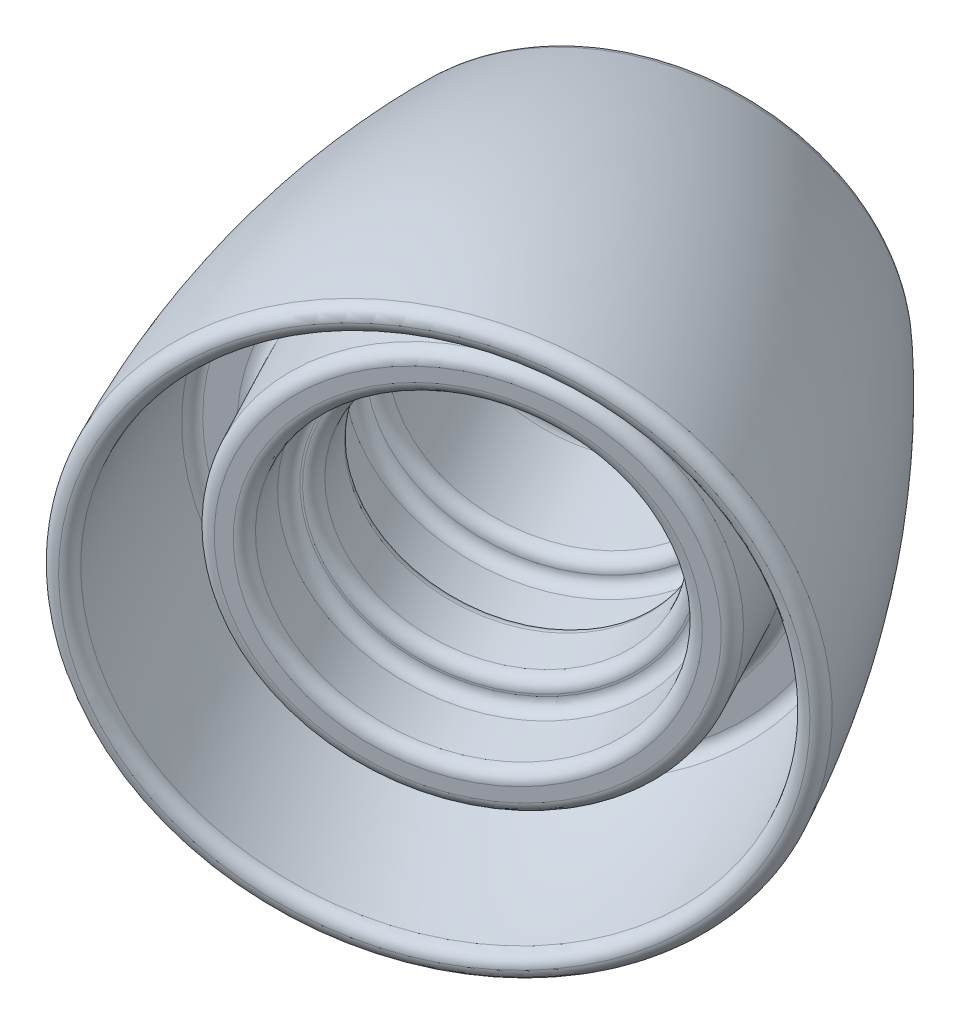
ISO-10303-21;
HEADER;
FILE_DESCRIPTION(('STEP AP214'),'2;1');
FILE_NAME('part.step','',(''),(''),'','','');
FILE_SCHEMA(('AUTOMOTIVE_DESIGN { 1 0 10303 214 1 1 1 1 }'));
ENDSEC;
DATA;
#1=APPLICATION_CONTEXT('core data for automotive mechanical design processes');
#2=APPLICATION_PROTOCOL_DEFINITION('international standard','automotive_design',2000,#1);
#3=PRODUCT_CONTEXT('',#1,'mechanical');
#4=PRODUCT('Part','Part','',(#3));
#5=PRODUCT_RELATED_PRODUCT_CATEGORY('part','',(#4));
#6=PRODUCT_DEFINITION_FORMATION('','',#4);
#7=PRODUCT_DEFINITION_CONTEXT('part definition',#1,'design');
#8=PRODUCT_DEFINITION('design','',#6,#7);
#9=PRODUCT_DEFINITION_SHAPE('','',#8);
#10=(LENGTH_UNIT() NAMED_UNIT(*) SI_UNIT(.MILLI.,.METRE.));
#11=(NAMED_UNIT(*) PLANE_ANGLE_UNIT() SI_UNIT($,.RADIAN.));
#12=(NAMED_UNIT(*) SI_UNIT($,.STERADIAN.) SOLID_ANGLE_UNIT());
#13=UNCERTAINTY_MEASURE_WITH_UNIT(LENGTH_MEASURE(1.E-05),#10,'distance_accuracy_value','');
#14=(GEOMETRIC_REPRESENTATION_CONTEXT(3) GLOBAL_UNCERTAINTY_ASSIGNED_CONTEXT((#13)) GLOBAL_UNIT_ASSIGNED_CONTEXT((#10,
#11,#12)) REPRESENTATION_CONTEXT('',''));
#15=CARTESIAN_POINT('',(0.,0.,0.));
#16=DIRECTION('',(0.,0.,1.));
#17=DIRECTION('',(1.,0.,0.));
#18=AXIS2_PLACEMENT_3D('',#15,#16,#17);
#19=CARTESIAN_POINT('',(-1.82840361063118,-8.23663197239245,23.7918539048536));
#20=DIRECTION('',(0.453212083113773,-0.0300186712748521,0.890897124866035));
#21=DIRECTION('',(-0.41626094218873,-0.890897124866035,0.181739211271491));
#22=AXIS2_PLACEMENT_3D('',#19,#20,#21);
#23=CYLINDRICAL_SURFACE('',#22,3.24582561371548);
#24=CARTESIAN_POINT('',(-6.10445961480962,-7.95340580891422,15.3862395317425));
#25=DIRECTION('',(0.453212083113773,-0.0300186712748521,0.890897124866035));
#26=DIRECTION('',(-0.41626094218873,-0.890897124866035,0.181739211271491));
#27=AXIS2_PLACEMENT_3D('',#24,#25,#26);
#28=CIRCLE('',#27,3.24582561371548);
#29=CARTESIAN_POINT('',(-7.45557004295514,-10.8451025159899,15.976133318704));
#30=VERTEX_POINT('',#29);
#31=EDGE_CURVE('E95',#30,#30,#28,.F.);
#32=ORIENTED_EDGE('',*,*,#31,.T.);
#33=EDGE_LOOP('',(#32));
#34=FACE_BOUND('',#33,.T.);
#35=CARTESIAN_POINT('',(-5.60592632338447,-7.98642634731656,16.3662263690952));
#36=DIRECTION('',(-0.453212083113773,0.0300186712748521,-0.890897124866035));
#37=DIRECTION('',(0.41626094218873,0.890897124866035,-0.181739211271491));
#38=AXIS2_PLACEMENT_3D('',#35,#36,#37);
#39=CIRCLE('',#38,3.24582561371548);
#40=CARTESIAN_POINT('',(-4.25481589523895,-5.09472964024091,15.7763325821337));
#41=VERTEX_POINT('',#40);
#42=EDGE_CURVE('E98',#41,#41,#39,.F.);
#43=ORIENTED_EDGE('',*,*,#42,.T.);
#44=EDGE_LOOP('',(#43));
#45=FACE_BOUND('',#44,.T.);
#46=ADVANCED_FACE('F15',(#34,#45),#23,.F.);
#47=CARTESIAN_POINT('',(-4.36631390040934,-5.58336181099489,16.0972048205766));
#48=DIRECTION('',(-0.453212083113773,0.0300186712748521,-0.890897124866035));
#49=DIRECTION('',(0.41626094218873,0.890897124866035,-0.181739211271491));
#50=AXIS2_PLACEMENT_3D('',#47,#48,#49);
#51=PLANE('',#50);
#52=CARTESIAN_POINT('',(-5.49262330260603,-7.99393101513527,16.5889506503116));
#53=DIRECTION('',(-0.453212083113773,0.0300186712748521,-0.890897124866035));
#54=DIRECTION('',(0.41626094218873,0.890897124866035,-0.181739211271491));
#55=AXIS2_PLACEMENT_3D('',#52,#53,#54);
#56=CIRCLE('',#55,2.99582561371548);
#57=CARTESIAN_POINT('',(-4.24557811000769,-5.32495858927612,16.0444916661681));
#58=VERTEX_POINT('',#57);
#59=EDGE_CURVE('E88',#58,#58,#56,.T.);
#60=ORIENTED_EDGE('',*,*,#59,.T.);
#61=EDGE_LOOP('',(#60));
#62=FACE_BOUND('',#61,.T.);
#63=CARTESIAN_POINT('',(-5.49262330260603,-7.99393101513527,16.5889506503116));
#64=DIRECTION('',(-0.453212083113773,0.0300186712748521,-0.890897124866035));
#65=DIRECTION('',(0.41626094218873,0.890897124866035,-0.181739211271491));
#66=AXIS2_PLACEMENT_3D('',#63,#64,#65);
#67=CIRCLE('',#66,2.95577728545579);
#68=CARTESIAN_POINT('',(-4.26224866486216,-5.36063752977838,16.0517700177587));
#69=VERTEX_POINT('',#68);
#70=EDGE_CURVE('E91',#69,#69,#67,.F.);
#71=ORIENTED_EDGE('',*,*,#70,.T.);
#72=EDGE_LOOP('',(#71));
#73=FACE_BOUND('',#72,.T.);
#74=ADVANCED_FACE('F181',(#62,#73),#51,.T.);
#75=CARTESIAN_POINT('',(-1.82840361063118,-8.23663197239245,23.7918539048536));
#76=DIRECTION('',(0.453212083113773,-0.0300186712748521,0.890897124866035));
#77=DIRECTION('',(-0.41626094218873,-0.890897124866035,0.181739211271491));
#78=AXIS2_PLACEMENT_3D('',#75,#76,#77);
#79=CYLINDRICAL_SURFACE('',#78,2.70577728545579);
#80=CARTESIAN_POINT('',(-5.37932028182759,-8.00143568295398,16.8116749315281));
#81=DIRECTION('',(-0.453212083113773,0.0300186712748521,-0.890897124866035));
#82=DIRECTION('',(0.41626094218873,0.890897124866035,-0.181739211271491));
#83=AXIS2_PLACEMENT_3D('',#80,#81,#82);
#84=CIRCLE('',#83,2.70577728545579);
#85=CARTESIAN_POINT('',(-4.2530108796309,-5.5908664788136,16.3199291017931));
#86=VERTEX_POINT('',#85);
#87=EDGE_CURVE('E80',#86,#86,#84,.T.);
#88=ORIENTED_EDGE('',*,*,#87,.T.);
#89=EDGE_LOOP('',(#88));
#90=FACE_BOUND('',#89,.T.);
#91=CARTESIAN_POINT('',(-4.97142940702519,-8.02845248710135,17.6134823439076));
#92=DIRECTION('',(0.453212083113773,-0.0300186712748521,0.890897124866035));
#93=DIRECTION('',(-0.41626094218873,-0.890897124866035,0.181739211271491));
#94=AXIS2_PLACEMENT_3D('',#91,#92,#93);
#95=CIRCLE('',#94,2.70577728545579);
#96=CARTESIAN_POINT('',(-6.09773880922188,-10.4390216912417,18.1052281736427));
#97=VERTEX_POINT('',#96);
#98=EDGE_CURVE('E84',#97,#97,#95,.T.);
#99=ORIENTED_EDGE('',*,*,#98,.T.);
#100=EDGE_LOOP('',(#99));
#101=FACE_BOUND('',#100,.T.);
#102=ADVANCED_FACE('F177',(#90,#101),#79,.F.);
#103=CARTESIAN_POINT('',(-3.73181698405006,-5.62538795077968,17.3444607953891));
#104=DIRECTION('',(0.453212083113773,-0.0300186712748521,0.890897124866035));
#105=DIRECTION('',(-0.41626094218873,-0.890897124866035,0.181739211271491));
#106=AXIS2_PLACEMENT_3D('',#103,#104,#105);
#107=PLANE('',#106);
#108=CARTESIAN_POINT('',(-4.85812638624674,-8.03595715492006,17.8362066251241));
#109=DIRECTION('',(0.453212083113773,-0.0300186712748521,0.890897124866035));
#110=DIRECTION('',(-0.41626094218873,-0.890897124866035,0.181739211271491));
#111=AXIS2_PLACEMENT_3D('',#108,#109,#110);
#112=CIRCLE('',#111,2.95577728545579);
#113=CARTESIAN_POINT('',(-6.08850102399061,-10.669250640277,18.373387257677));
#114=VERTEX_POINT('',#113);
#115=EDGE_CURVE('E72',#114,#114,#112,.F.);
#116=ORIENTED_EDGE('',*,*,#115,.T.);
#117=EDGE_LOOP('',(#116));
#118=FACE_BOUND('',#117,.T.);
#119=CARTESIAN_POINT('',(-4.85812638624674,-8.03595715492006,17.8362066251241));
#120=DIRECTION('',(0.453212083113773,-0.0300186712748521,0.890897124866035));
#121=DIRECTION('',(-0.41626094218873,-0.890897124866035,0.181739211271491));
#122=AXIS2_PLACEMENT_3D('',#119,#120,#121);
#123=CIRCLE('',#122,2.99582561371548);
#124=CARTESIAN_POINT('',(-6.10517157884508,-10.7049295807792,18.3806656092677));
#125=VERTEX_POINT('',#124);
#126=EDGE_CURVE('E76',#125,#125,#123,.T.);
#127=ORIENTED_EDGE('',*,*,#126,.T.);
#128=EDGE_LOOP('',(#127));
#129=FACE_BOUND('',#128,.T.);
#130=ADVANCED_FACE('F173',(#118,#129),#107,.T.);
#131=CARTESIAN_POINT('',(-1.82840361063118,-8.23663197239245,23.7918539048536));
#132=DIRECTION('',(0.453212083113773,-0.0300186712748521,0.890897124866035));
#133=DIRECTION('',(-0.41626094218873,-0.890897124866035,0.181739211271491));
#134=AXIS2_PLACEMENT_3D('',#131,#132,#133);
#135=CYLINDRICAL_SURFACE('',#134,3.24582561371548);
#136=CARTESIAN_POINT('',(-4.7448233654683,-8.04346182273878,18.0589309063406));
#137=DIRECTION('',(0.453212083113773,-0.0300186712748521,0.890897124866035));
#138=DIRECTION('',(-0.41626094218873,-0.890897124866035,0.181739211271491));
#139=AXIS2_PLACEMENT_3D('',#136,#137,#138);
#140=CIRCLE('',#139,3.24582561371548);
#141=CARTESIAN_POINT('',(-6.09593379361382,-10.9351585298144,18.6488246933021));
#142=VERTEX_POINT('',#141);
#143=EDGE_CURVE('E64',#142,#142,#140,.F.);
#144=ORIENTED_EDGE('',*,*,#143,.T.);
#145=EDGE_LOOP('',(#144));
#146=FACE_BOUND('',#145,.T.);
#147=CARTESIAN_POINT('',(-4.2853736463624,-8.07389364615885,18.9620896018452));
#148=DIRECTION('',(0.453212083113773,-0.0300186712748521,0.890897124866035));
#149=DIRECTION('',(-0.41626094218873,-0.890897124866035,0.181739211271491));
#150=AXIS2_PLACEMENT_3D('',#147,#148,#149);
#151=CIRCLE('',#150,3.24582561371548);
#152=CARTESIAN_POINT('',(-5.63648407450792,-10.9655903532345,19.5519833888067));
#153=VERTEX_POINT('',#152);
#154=EDGE_CURVE('E68',#153,#153,#151,.T.);
#155=ORIENTED_EDGE('',*,*,#154,.T.);
#156=EDGE_LOOP('',(#155));
#157=FACE_BOUND('',#156,.T.);
#158=ADVANCED_FACE('F169',(#146,#157),#135,.F.);
#159=CARTESIAN_POINT('',(-2.82096019743843,-5.18970160690191,18.5949200961003));
#160=DIRECTION('',(0.453212083113773,-0.0300186712748521,0.890897124866035));
#161=DIRECTION('',(-0.41626094218873,-0.890897124866035,0.181739211271491));
#162=AXIS2_PLACEMENT_3D('',#159,#160,#161);
#163=PLANE('',#162);
#164=CARTESIAN_POINT('',(-4.17207062558396,-8.08139831397756,19.1848138830617));
#165=DIRECTION('',(0.453212083113773,-0.0300186712748521,0.890897124866035));
#166=DIRECTION('',(-0.41626094218873,-0.890897124866035,0.181739211271491));
#167=AXIS2_PLACEMENT_3D('',#164,#165,#166);
#168=CIRCLE('',#167,3.49582561371548);
#169=CARTESIAN_POINT('',(-5.62724628927666,-11.1958193022697,19.8201424728411));
#170=VERTEX_POINT('',#169);
#171=EDGE_CURVE('E38',#170,#170,#168,.F.);
#172=ORIENTED_EDGE('',*,*,#171,.T.);
#173=EDGE_LOOP('',(#172));
#174=FACE_BOUND('',#173,.T.);
#175=CARTESIAN_POINT('',(-4.17207062558396,-8.08139831397756,19.1848138830617));
#176=DIRECTION('',(0.453212083113773,-0.0300186712748521,0.890897124866035));
#177=DIRECTION('',(-0.41626094218873,-0.890897124866035,0.181739211271491));
#178=AXIS2_PLACEMENT_3D('',#175,#176,#177);
#179=CIRCLE('',#178,3.77857088456341);
#180=CARTESIAN_POINT('',(-5.74494210211922,-11.4477162511376,19.8715283753557));
#181=VERTEX_POINT('',#180);
#182=EDGE_CURVE('E44',#181,#181,#179,.T.);
#183=ORIENTED_EDGE('',*,*,#182,.T.);
#184=EDGE_LOOP('',(#183));
#185=FACE_BOUND('',#184,.T.);
#186=ADVANCED_FACE('F165',(#174,#185),#163,.T.);
#187=CARTESIAN_POINT('',(-1.82840361063118,-8.23663197239245,23.7918539048536));
#188=DIRECTION('',(0.453212083113773,-0.0300186712748521,0.890897124866035));
#189=DIRECTION('',(-0.41626094218873,-0.890897124866035,0.181739211271491));
#190=AXIS2_PLACEMENT_3D('',#187,#188,#189);
#191=CYLINDRICAL_SURFACE('',#190,4.02857088456341);
#192=CARTESIAN_POINT('',(-5.2320599834361,-8.01118952371409,17.1011503919848));
#193=DIRECTION('',(0.453212083113773,-0.0300186712748521,0.890897124866035));
#194=DIRECTION('',(-0.41626094218873,-0.890897124866035,0.181739211271491));
#195=AXIS2_PLACEMENT_3D('',#192,#193,#194);
#196=CIRCLE('',#195,4.02857088456341);
#197=CARTESIAN_POINT('',(-6.90899669551855,-11.6002317420906,17.8332996870967));
#198=VERTEX_POINT('',#197);
#199=EDGE_CURVE('E56',#198,#198,#196,.T.);
#200=ORIENTED_EDGE('',*,*,#199,.T.);
#201=EDGE_LOOP('',(#200));
#202=FACE_BOUND('',#201,.T.);
#203=CARTESIAN_POINT('',(-4.2853736463624,-8.07389364615885,18.9620896018452));
#204=DIRECTION('',(0.453212083113773,-0.0300186712748521,0.890897124866035));
#205=DIRECTION('',(-0.41626094218873,-0.890897124866035,0.181739211271491));
#206=AXIS2_PLACEMENT_3D('',#203,#204,#205);
#207=CIRCLE('',#206,4.02857088456341);
#208=CARTESIAN_POINT('',(-5.96231035844485,-11.6629358645354,19.694238896957));
#209=VERTEX_POINT('',#208);
#210=EDGE_CURVE('E60',#209,#209,#207,.F.);
#211=ORIENTED_EDGE('',*,*,#210,.T.);
#212=EDGE_LOOP('',(#211));
#213=FACE_BOUND('',#212,.T.);
#214=ADVANCED_FACE('F161',(#202,#213),#191,.T.);
#215=CARTESIAN_POINT('',(-3.6684262921321,-4.41464263751883,16.1462768156565));
#216=DIRECTION('',(0.453212083113773,-0.0300186712748521,0.890897124866035));
#217=DIRECTION('',(-0.41626094218873,-0.890897124866035,0.181739211271491));
#218=AXIS2_PLACEMENT_3D('',#215,#216,#217);
#219=PLANE('',#218);
#220=CARTESIAN_POINT('',(-5.34536300421455,-8.00368485589538,16.8784261107683));
#221=DIRECTION('',(0.453212083113773,-0.0300186712748521,0.890897124866035));
#222=DIRECTION('',(-0.41626094218873,-0.890897124866035,0.181739211271491));
#223=AXIS2_PLACEMENT_3D('',#220,#221,#222);
#224=CIRCLE('',#223,4.2785708845634);
#225=CARTESIAN_POINT('',(-7.12636495184418,-11.8154513554884,17.656010208698));
#226=VERTEX_POINT('',#225);
#227=EDGE_CURVE('E48',#226,#226,#224,.F.);
#228=ORIENTED_EDGE('',*,*,#227,.T.);
#229=EDGE_LOOP('',(#228));
#230=FACE_BOUND('',#229,.T.);
#231=CARTESIAN_POINT('',(-5.34536300421455,-8.00368485589538,16.8784261107683));
#232=DIRECTION('',(0.453212083113773,-0.0300186712748521,0.890897124866035));
#233=DIRECTION('',(-0.41626094218873,-0.890897124866035,0.181739211271491));
#234=AXIS2_PLACEMENT_3D('',#231,#232,#233);
#235=CIRCLE('',#234,4.79273774166151);
#236=CARTESIAN_POINT('',(-7.34039253222206,-12.2735211301786,17.749454487769));
#237=VERTEX_POINT('',#236);
#238=EDGE_CURVE('E52',#237,#237,#235,.T.);
#239=ORIENTED_EDGE('',*,*,#238,.T.);
#240=EDGE_LOOP('',(#239));
#241=FACE_BOUND('',#240,.T.);
#242=ADVANCED_FACE('F157',(#230,#241),#219,.T.);
#243=CARTESIAN_POINT('',(-5.92820484945405,-4.55561842241409,12.0205937841694));
#244=CARTESIAN_POINT('',(-5.49588790536874,-4.33531117061553,12.5993762028067));
#245=CARTESIAN_POINT('',(-4.64271846800315,-3.95010381774629,13.7955572675327));
#246=CARTESIAN_POINT('',(-3.44076764867436,-3.5609253915247,15.647875886709));
#247=CARTESIAN_POINT('',(-2.30642175990726,-3.35375627529409,17.5703422472452));
#248=CARTESIAN_POINT('',(-1.59087960974788,-3.33850083961202,18.9087010873886));
#249=CARTESIAN_POINT('',(-1.24880630666905,-3.36115630113467,19.5811262065507));
#250=B_SPLINE_CURVE_WITH_KNOTS('',3,(#243,#244,#245,#246,#247,#248,#249),.UNSPECIFIED.,.F.,.F.,
(4,1,1,1,4),(0.,0.25,0.5,0.75,1.),.UNSPECIFIED.);
#251=CARTESIAN_POINT('',(-1.82840361063118,-8.23663197239245,23.7918539048536));
#252=DIRECTION('',(0.453212083113773,-0.0300186712748521,0.890897124866035));
#253=AXIS1_PLACEMENT('',#251,#252);
#254=SURFACE_OF_REVOLUTION('',#250,#253);
#255=CARTESIAN_POINT('',(-5.25007855398893,-8.00999605697651,17.0657305669232));
#256=DIRECTION('',(0.453212083113773,-0.0300186712748521,0.890897124866035));
#257=DIRECTION('',(-0.41626094218873,-0.890897124866035,0.181739211271491));
#258=AXIS2_PLACEMENT_3D('',#255,#256,#257);
#259=CIRCLE('',#258,5.03955618251426);
#260=CARTESIAN_POINT('',(-7.34784895873536,-12.4997221705793,17.9816155326917));
#261=VERTEX_POINT('',#260);
#262=EDGE_CURVE('E31',#261,#261,#259,.F.);
#263=ORIENTED_EDGE('',*,*,#262,.T.);
#264=EDGE_LOOP('',(#263));
#265=FACE_BOUND('',#264,.T.);
#266=CARTESIAN_POINT('',(-3.58801419079784,-8.120083509662,20.3329169851139));
#267=DIRECTION('',(0.453212083113773,-0.0300186712748521,0.890897124866035));
#268=DIRECTION('',(-0.41626094218873,-0.890897124866035,0.181739211271491));
#269=AXIS2_PLACEMENT_3D('',#266,#267,#268);
#270=CIRCLE('',#269,5.34884288988972);
#271=CARTESIAN_POINT('',(-5.81452857176283,-12.8853522616249,21.3050114731376));
#272=VERTEX_POINT('',#271);
#273=EDGE_CURVE('E102',#272,#272,#270,.T.);
#274=ORIENTED_EDGE('',*,*,#273,.T.);
#275=EDGE_LOOP('',(#274));
#276=FACE_BOUND('',#275,.T.);
#277=ADVANCED_FACE('F153',(#265,#276),#254,.F.);
#278=CARTESIAN_POINT('',(-1.24880630666905,-3.36115630113466,19.5811262065507));
#279=DIRECTION('',(0.453212083113773,-0.0300186712748521,0.890897124866035));
#280=DIRECTION('',(-0.41626094218873,-0.890897124866035,0.181739211271491));
#281=AXIS2_PLACEMENT_3D('',#278,#279,#280);
#282=PLANE('',#281);
#283=CARTESIAN_POINT('',(-3.47582953274974,-8.12751410230836,20.5534428559655));
#284=DIRECTION('',(0.453212083113773,-0.0300186712748521,0.890897124866035));
#285=DIRECTION('',(-0.41626094218873,-0.890897124866035,0.181739211271491));
#286=AXIS2_PLACEMENT_3D('',#283,#284,#285);
#287=CIRCLE('',#286,5.59884535934687);
#288=CARTESIAN_POINT('',(-5.80641017720047,-13.11550933552,21.5709725956042));
#289=VERTEX_POINT('',#288);
#290=EDGE_CURVE('E110',#289,#289,#287,.T.);
#291=ORIENTED_EDGE('',*,*,#290,.T.);
#292=EDGE_LOOP('',(#291));
#293=FACE_BOUND('',#292,.T.);
#294=CARTESIAN_POINT('',(-3.47582953274974,-8.12751410230836,20.5534428559655));
#295=DIRECTION('',(0.453212083113773,-0.0300186712748521,0.890897124866035));
#296=DIRECTION('',(-0.41626094218873,-0.890897124866035,0.181739211271491));
#297=AXIS2_PLACEMENT_3D('',#294,#295,#296);
#298=CIRCLE('',#297,5.59883071113216);
#299=CARTESIAN_POINT('',(-5.80640407972081,-13.1154962854677,21.5709699334493));
#300=VERTEX_POINT('',#299);
#301=EDGE_CURVE('E114',#300,#300,#298,.F.);
#302=ORIENTED_EDGE('',*,*,#301,.T.);
#303=EDGE_LOOP('',(#302));
#304=FACE_BOUND('',#303,.T.);
#305=ADVANCED_FACE('F148',(#293,#304),#282,.T.);
#306=CARTESIAN_POINT('',(-1.04067583557468,-2.91570773870165,19.4902566009149));
#307=CARTESIAN_POINT('',(-3.14957677211419,-2.7760238990073,15.3447056524892));
#308=CARTESIAN_POINT('',(-5.81525249230326,-4.13443398663146,11.7759105578051));
#309=B_SPLINE_CURVE_WITH_KNOTS('',2,(#306,#307,#308),.UNSPECIFIED.,.F.,.F.,(3,3),(0.,1.),.UNSPECIFIED.);
#310=CARTESIAN_POINT('',(-1.82840361063118,-8.23663197239245,23.7918539048536));
#311=DIRECTION('',(0.453212083113773,-0.0300186712748521,0.890897124866035));
#312=AXIS1_PLACEMENT('',#310,#311);
#313=SURFACE_OF_REVOLUTION('',#309,#312);
#314=CARTESIAN_POINT('',(-3.59023929192932,-8.11993612925907,20.3285430147931));
#315=DIRECTION('',(0.453212083113773,-0.0300186712748521,0.890897124866035));
#316=DIRECTION('',(-0.41626094218873,-0.890897124866035,0.181739211271491));
#317=AXIS2_PLACEMENT_3D('',#314,#315,#316);
#318=CIRCLE('',#317,5.84883343245303);
#319=CARTESIAN_POINT('',(-6.02488020722716,-13.3306450180518,21.3915053896654));
#320=VERTEX_POINT('',#319);
#321=EDGE_CURVE('E106',#320,#320,#318,.F.);
#322=ORIENTED_EDGE('',*,*,#321,.T.);
#323=EDGE_LOOP('',(#322));
#324=FACE_BOUND('',#323,.T.);
#325=CARTESIAN_POINT('',(-7.40659112230369,-7.86715864310271,12.8265875289676));
#326=DIRECTION('',(0.453212083113773,-0.0300186712748521,0.890897124866035));
#327=DIRECTION('',(-0.41626094218873,-0.890897124866035,0.181739211271491));
#328=AXIS2_PLACEMENT_3D('',#325,#326,#327);
#329=CIRCLE('',#328,4.30199098337212);
#330=CARTESIAN_POINT('',(-9.19734194232959,-11.6997900413885,13.6084279771828));
#331=VERTEX_POINT('',#330);
#332=EDGE_CURVE('E128',#331,#331,#329,.T.);
#333=ORIENTED_EDGE('',*,*,#332,.T.);
#334=EDGE_LOOP('',(#333));
#335=FACE_BOUND('',#334,.T.);
#336=ADVANCED_FACE('F143',(#324,#335),#313,.F.);
#337=CARTESIAN_POINT('',(-6.41002068975469,-5.4073789674531,12.0355859011746));
#338=DIRECTION('',(-0.453212083113773,0.0300186712748521,-0.890897124866035));
#339=DIRECTION('',(0.41626094218873,0.890897124866035,-0.181739211271491));
#340=AXIS2_PLACEMENT_3D('',#337,#338,#339);
#341=PLANE('',#340);
#342=CARTESIAN_POINT('',(-7.55473828077369,-7.85734606083469,12.5353687321712));
#343=DIRECTION('',(-0.453212083113773,0.0300186712748521,-0.890897124866035));
#344=DIRECTION('',(0.41626094218873,0.890897124866035,-0.181739211271491));
#345=AXIS2_PLACEMENT_3D('',#342,#343,#344);
#346=CIRCLE('',#345,3.83291702671831);
#347=CARTESIAN_POINT('',(-5.9592446279007,-4.44261130188127,11.8387774148663));
#348=VERTEX_POINT('',#347);
#349=EDGE_CURVE('E121',#348,#348,#346,.T.);
#350=ORIENTED_EDGE('',*,*,#349,.T.);
#351=EDGE_LOOP('',(#350));
#352=FACE_BOUND('',#351,.T.);
#353=CARTESIAN_POINT('',(-7.55473828077369,-7.85734606083469,12.5353687321712));
#354=DIRECTION('',(-0.453212083113773,0.0300186712748521,-0.890897124866035));
#355=DIRECTION('',(0.41626094218873,0.890897124866035,-0.181739211271491));
#356=AXIS2_PLACEMENT_3D('',#353,#354,#355);
#357=CIRCLE('',#356,3.25);
#358=CARTESIAN_POINT('',(-6.20189021866032,-4.96193040502008,11.9447162955389));
#359=VERTEX_POINT('',#358);
#360=EDGE_CURVE('E125',#359,#359,#357,.F.);
#361=ORIENTED_EDGE('',*,*,#360,.T.);
#362=EDGE_LOOP('',(#361));
#363=FACE_BOUND('',#362,.T.);
#364=ADVANCED_FACE('F147',(#352,#363),#341,.T.);
#365=CARTESIAN_POINT('',(-1.82840361063118,-8.23663197239245,23.7918539048536));
#366=DIRECTION('',(0.453212083113773,-0.0300186712748521,0.890897124866035));
#367=DIRECTION('',(-0.41626094218873,-0.890897124866035,0.181739211271491));
#368=AXIS2_PLACEMENT_3D('',#365,#366,#367);
#369=CYLINDRICAL_SURFACE('',#368,2.75);
#370=CARTESIAN_POINT('',(-6.33105775878134,-7.93839699637629,14.9408064939086));
#371=DIRECTION('',(-0.453212083113773,0.0300186712748521,-0.890897124866035));
#372=DIRECTION('',(0.41626094218873,0.890897124866035,-0.181739211271491));
#373=AXIS2_PLACEMENT_3D('',#370,#371,#372);
#374=CIRCLE('',#373,2.75);
#375=CARTESIAN_POINT('',(-5.18634016776233,-5.48842990299469,14.441023662912));
#376=VERTEX_POINT('',#375);
#377=EDGE_CURVE('E23',#376,#376,#374,.F.);
#378=ORIENTED_EDGE('',*,*,#377,.T.);
#379=EDGE_LOOP('',(#378));
#380=FACE_BOUND('',#379,.T.);
#381=CARTESIAN_POINT('',(-7.32813223921681,-7.87235539647212,12.9808172946042));
#382=DIRECTION('',(-0.453212083113773,0.0300186712748521,-0.890897124866035));
#383=DIRECTION('',(0.41626094218873,0.890897124866035,-0.181739211271491));
#384=AXIS2_PLACEMENT_3D('',#381,#382,#383);
#385=CIRCLE('',#384,2.75);
#386=CARTESIAN_POINT('',(-6.1834146481978,-5.42238830309052,12.4810344636076));
#387=VERTEX_POINT('',#386);
#388=EDGE_CURVE('E118',#387,#387,#385,.T.);
#389=ORIENTED_EDGE('',*,*,#388,.T.);
#390=EDGE_LOOP('',(#389));
#391=FACE_BOUND('',#390,.T.);
#392=ADVANCED_FACE('F193',(#380,#391),#369,.F.);
#393=CARTESIAN_POINT('',(-7.32813223921681,-7.87235539647212,12.9808172946042));
#394=DIRECTION('',(0.453212083113773,-0.0300186712748521,0.890897124866035));
#395=DIRECTION('',(-0.41626094218873,-0.890897124866035,0.181739211271491));
#396=AXIS2_PLACEMENT_3D('',#393,#394,#395);
#397=TOROIDAL_SURFACE('',#396,3.83291702671831,0.5);
#398=ORIENTED_EDGE('',*,*,#349,.F.);
#399=EDGE_LOOP('',(#398));
#400=FACE_BOUND('',#399,.T.);
#401=ORIENTED_EDGE('',*,*,#332,.F.);
#402=EDGE_LOOP('',(#401));
#403=FACE_BOUND('',#402,.T.);
#404=ADVANCED_FACE('F189',(#400,#403),#397,.T.);
#405=CARTESIAN_POINT('',(-7.32813223921681,-7.87235539647212,12.9808172946042));
#406=DIRECTION('',(-0.453212083113773,0.0300186712748521,-0.890897124866035));
#407=DIRECTION('',(0.41626094218873,0.890897124866035,-0.181739211271491));
#408=AXIS2_PLACEMENT_3D('',#405,#406,#407);
#409=TOROIDAL_SURFACE('',#408,3.25,0.5);
#410=ORIENTED_EDGE('',*,*,#388,.F.);
#411=EDGE_LOOP('',(#410));
#412=FACE_BOUND('',#411,.T.);
#413=ORIENTED_EDGE('',*,*,#360,.F.);
#414=EDGE_LOOP('',(#413));
#415=FACE_BOUND('',#414,.T.);
#416=ADVANCED_FACE('F192',(#412,#415),#409,.T.);
#417=CARTESIAN_POINT('',(-3.58913255352817,-8.12000943448965,20.330718574749));
#418=DIRECTION('',(0.453212083113773,-0.0300186712748521,0.890897124866035));
#419=DIRECTION('',(-0.41626094218873,-0.890897124866035,0.181739211271491));
#420=AXIS2_PLACEMENT_3D('',#417,#418,#419);
#421=TOROIDAL_SURFACE('',#420,5.59884535934687,0.25);
#422=ORIENTED_EDGE('',*,*,#321,.F.);
#423=EDGE_LOOP('',(#422));
#424=FACE_BOUND('',#423,.T.);
#425=ORIENTED_EDGE('',*,*,#290,.F.);
#426=EDGE_LOOP('',(#425));
#427=FACE_BOUND('',#426,.T.);
#428=ADVANCED_FACE('F197',(#424,#427),#421,.T.);
#429=CARTESIAN_POINT('',(-3.58913255352819,-8.12000943448965,20.330718574749));
#430=DIRECTION('',(0.453212083113773,-0.0300186712748521,0.890897124866035));
#431=DIRECTION('',(-0.41626094218873,-0.890897124866035,0.181739211271491));
#432=AXIS2_PLACEMENT_3D('',#429,#430,#431);
#433=TOROIDAL_SURFACE('',#432,5.59883071113216,0.25);
#434=ORIENTED_EDGE('',*,*,#301,.F.);
#435=EDGE_LOOP('',(#434));
#436=FACE_BOUND('',#435,.T.);
#437=ORIENTED_EDGE('',*,*,#273,.F.);
#438=EDGE_LOOP('',(#437));
#439=FACE_BOUND('',#438,.T.);
#440=ADVANCED_FACE('F201',(#436,#439),#433,.T.);
#441=CARTESIAN_POINT('',(-6.10445961480962,-7.95340580891422,15.3862395317425));
#442=DIRECTION('',(0.453212083113773,-0.0300186712748521,0.890897124866035));
#443=DIRECTION('',(-0.41626094218873,-0.890897124866035,0.181739211271491));
#444=AXIS2_PLACEMENT_3D('',#441,#442,#443);
#445=TOROIDAL_SURFACE('',#444,2.99582561371548,0.25);
#446=CARTESIAN_POINT('',(-6.21775868682538,-7.94590140264327,15.1635230127668));
#447=DIRECTION('',(0.453212083113773,-0.0300186712748521,0.890897124866035));
#448=DIRECTION('',(-0.41626094218873,-0.890897124866035,0.181739211271491));
#449=AXIS2_PLACEMENT_3D('',#446,#447,#448);
#450=CIRCLE('',#449,2.99791280685829);
#451=CARTESIAN_POINT('',(-7.46567269640787,-10.6167333028724,15.7083613217459));
#452=VERTEX_POINT('',#451);
#453=EDGE_CURVE('E10',#452,#452,#450,.F.);
#454=ORIENTED_EDGE('',*,*,#453,.T.);
#455=EDGE_LOOP('',(#454));
#456=FACE_BOUND('',#455,.T.);
#457=ORIENTED_EDGE('',*,*,#31,.F.);
#458=EDGE_LOOP('',(#457));
#459=FACE_BOUND('',#458,.T.);
#460=ADVANCED_FACE('F205',(#456,#459),#445,.F.);
#461=CARTESIAN_POINT('',(-5.60592632338447,-7.98642634731656,16.3662263690952));
#462=DIRECTION('',(-0.453212083113773,0.0300186712748521,-0.890897124866035));
#463=DIRECTION('',(0.41626094218873,0.890897124866035,-0.181739211271491));
#464=AXIS2_PLACEMENT_3D('',#461,#462,#463);
#465=TOROIDAL_SURFACE('',#464,2.99582561371548,0.25);
#466=ORIENTED_EDGE('',*,*,#59,.F.);
#467=EDGE_LOOP('',(#466));
#468=FACE_BOUND('',#467,.T.);
#469=ORIENTED_EDGE('',*,*,#42,.F.);
#470=EDGE_LOOP('',(#469));
#471=FACE_BOUND('',#470,.T.);
#472=ADVANCED_FACE('F209',(#468,#471),#465,.F.);
#473=CARTESIAN_POINT('',(-5.37932028182759,-8.00143568295398,16.8116749315281));
#474=DIRECTION('',(-0.453212083113773,0.0300186712748521,-0.890897124866035));
#475=DIRECTION('',(0.41626094218873,0.890897124866035,-0.181739211271491));
#476=AXIS2_PLACEMENT_3D('',#473,#474,#475);
#477=TOROIDAL_SURFACE('',#476,2.95577728545579,0.25);
#478=ORIENTED_EDGE('',*,*,#87,.F.);
#479=EDGE_LOOP('',(#478));
#480=FACE_BOUND('',#479,.T.);
#481=ORIENTED_EDGE('',*,*,#70,.F.);
#482=EDGE_LOOP('',(#481));
#483=FACE_BOUND('',#482,.T.);
#484=ADVANCED_FACE('F212',(#480,#483),#477,.T.);
#485=CARTESIAN_POINT('',(-4.97142940702519,-8.02845248710135,17.6134823439076));
#486=DIRECTION('',(0.453212083113773,-0.0300186712748521,0.890897124866035));
#487=DIRECTION('',(-0.41626094218873,-0.890897124866035,0.181739211271491));
#488=AXIS2_PLACEMENT_3D('',#485,#486,#487);
#489=TOROIDAL_SURFACE('',#488,2.95577728545579,0.25);
#490=ORIENTED_EDGE('',*,*,#115,.F.);
#491=EDGE_LOOP('',(#490));
#492=FACE_BOUND('',#491,.T.);
#493=ORIENTED_EDGE('',*,*,#98,.F.);
#494=EDGE_LOOP('',(#493));
#495=FACE_BOUND('',#494,.T.);
#496=ADVANCED_FACE('F216',(#492,#495),#489,.T.);
#497=CARTESIAN_POINT('',(-4.7448233654683,-8.04346182273878,18.0589309063406));
#498=DIRECTION('',(0.453212083113773,-0.0300186712748521,0.890897124866035));
#499=DIRECTION('',(-0.41626094218873,-0.890897124866035,0.181739211271491));
#500=AXIS2_PLACEMENT_3D('',#497,#498,#499);
#501=TOROIDAL_SURFACE('',#500,2.99582561371548,0.25);
#502=ORIENTED_EDGE('',*,*,#143,.F.);
#503=EDGE_LOOP('',(#502));
#504=FACE_BOUND('',#503,.T.);
#505=ORIENTED_EDGE('',*,*,#126,.F.);
#506=EDGE_LOOP('',(#505));
#507=FACE_BOUND('',#506,.T.);
#508=ADVANCED_FACE('F220',(#504,#507),#501,.F.);
#509=CARTESIAN_POINT('',(-5.2320599834361,-8.01118952371409,17.1011503919848));
#510=DIRECTION('',(0.453212083113773,-0.0300186712748521,0.890897124866035));
#511=DIRECTION('',(-0.41626094218873,-0.890897124866035,0.181739211271491));
#512=AXIS2_PLACEMENT_3D('',#509,#510,#511);
#513=TOROIDAL_SURFACE('',#512,4.2785708845634,0.25);
#514=ORIENTED_EDGE('',*,*,#227,.F.);
#515=EDGE_LOOP('',(#514));
#516=FACE_BOUND('',#515,.T.);
#517=ORIENTED_EDGE('',*,*,#199,.F.);
#518=EDGE_LOOP('',(#517));
#519=FACE_BOUND('',#518,.T.);
#520=ADVANCED_FACE('F224',(#516,#519),#513,.F.);
#521=CARTESIAN_POINT('',(-4.2853736463624,-8.07389364615885,18.9620896018452));
#522=DIRECTION('',(0.453212083113773,-0.0300186712748521,0.890897124866035));
#523=DIRECTION('',(-0.41626094218873,-0.890897124866035,0.181739211271491));
#524=AXIS2_PLACEMENT_3D('',#521,#522,#523);
#525=TOROIDAL_SURFACE('',#524,3.49582561371548,0.25);
#526=ORIENTED_EDGE('',*,*,#171,.F.);
#527=EDGE_LOOP('',(#526));
#528=FACE_BOUND('',#527,.T.);
#529=ORIENTED_EDGE('',*,*,#154,.F.);
#530=EDGE_LOOP('',(#529));
#531=FACE_BOUND('',#530,.T.);
#532=ADVANCED_FACE('F228',(#528,#531),#525,.T.);
#533=CARTESIAN_POINT('',(-4.2853736463624,-8.07389364615885,18.9620896018452));
#534=DIRECTION('',(0.453212083113773,-0.0300186712748521,0.890897124866035));
#535=DIRECTION('',(-0.41626094218873,-0.890897124866035,0.181739211271491));
#536=AXIS2_PLACEMENT_3D('',#533,#534,#535);
#537=TOROIDAL_SURFACE('',#536,3.77857088456341,0.25);
#538=ORIENTED_EDGE('',*,*,#210,.F.);
#539=EDGE_LOOP('',(#538));
#540=FACE_BOUND('',#539,.T.);
#541=ORIENTED_EDGE('',*,*,#182,.F.);
#542=EDGE_LOOP('',(#541));
#543=FACE_BOUND('',#542,.T.);
#544=ADVANCED_FACE('F232',(#540,#543),#537,.T.);
#545=CARTESIAN_POINT('',(-5.23205998343608,-8.0111895237141,17.1011503919849));
#546=DIRECTION('',(0.453212083113773,-0.0300186712748521,0.890897124866035));
#547=DIRECTION('',(-0.41626094218873,-0.890897124866035,0.181739211271491));
#548=AXIS2_PLACEMENT_3D('',#545,#546,#547);
#549=TOROIDAL_SURFACE('',#548,4.79273774166151,0.25);
#550=ORIENTED_EDGE('',*,*,#262,.F.);
#551=EDGE_LOOP('',(#550));
#552=FACE_BOUND('',#551,.T.);
#553=ORIENTED_EDGE('',*,*,#238,.F.);
#554=EDGE_LOOP('',(#553));
#555=FACE_BOUND('',#554,.T.);
#556=ADVANCED_FACE('F235',(#552,#555),#549,.F.);
#557=CARTESIAN_POINT('',(-6.33105775878134,-7.93839699637629,14.9408064939086));
#558=DIRECTION('',(-0.453212083113773,0.0300186712748521,-0.890897124866035));
#559=DIRECTION('',(0.41626094218873,0.890897124866035,-0.181739211271491));
#560=AXIS2_PLACEMENT_3D('',#557,#558,#559);
#561=TOROIDAL_SURFACE('',#560,3.,0.25);
#562=ORIENTED_EDGE('',*,*,#453,.F.);
#563=EDGE_LOOP('',(#562));
#564=FACE_BOUND('',#563,.T.);
#565=ORIENTED_EDGE('',*,*,#377,.F.);
#566=EDGE_LOOP('',(#565));
#567=FACE_BOUND('',#566,.T.);
#568=ADVANCED_FACE('F17',(#564,#567),#561,.T.);
#569=CLOSED_SHELL('',(#46,#74,#102,#130,#158,#186,#214,#242,#277,#305,#336,#364,#392,#404,#416,
#428,#440,#460,#472,#484,#496,#508,#520,#532,#544,#556,#568));
#570=MANIFOLD_SOLID_BREP('B1',#569);
#571=ADVANCED_BREP_SHAPE_REPRESENTATION('',(#18,#570),#14);
#572=SHAPE_DEFINITION_REPRESENTATION(#9,#571);
ENDSEC;
END-ISO-10303-21;
